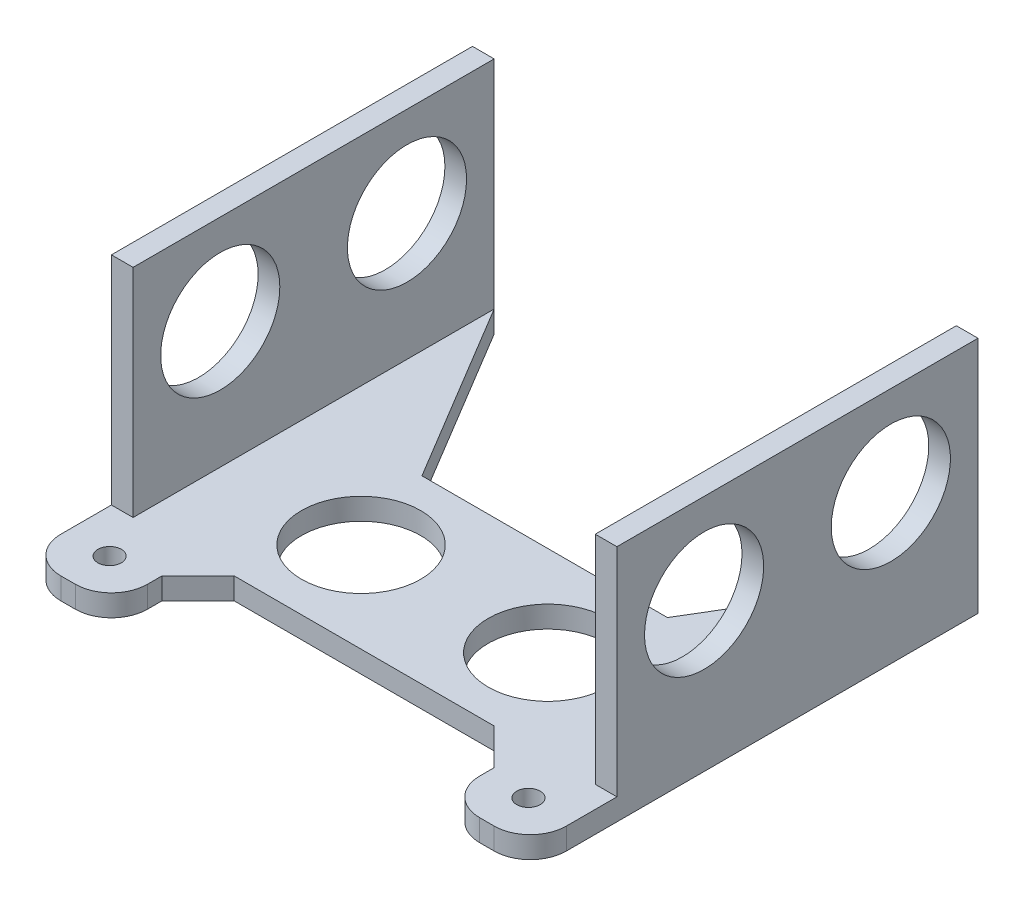
ISO-10303-21;
HEADER;
FILE_DESCRIPTION(('STEP AP214'),'2;1');
FILE_NAME('part.step','',(''),(''),'','','');
FILE_SCHEMA(('AUTOMOTIVE_DESIGN { 1 0 10303 214 1 1 1 1 }'));
ENDSEC;
DATA;
#1=APPLICATION_CONTEXT('core data for automotive mechanical design processes');
#2=APPLICATION_PROTOCOL_DEFINITION('international standard','automotive_design',2000,#1);
#3=PRODUCT_CONTEXT('',#1,'mechanical');
#4=PRODUCT('Part','Part','',(#3));
#5=PRODUCT_RELATED_PRODUCT_CATEGORY('part','',(#4));
#6=PRODUCT_DEFINITION_FORMATION('','',#4);
#7=PRODUCT_DEFINITION_CONTEXT('part definition',#1,'design');
#8=PRODUCT_DEFINITION('design','',#6,#7);
#9=PRODUCT_DEFINITION_SHAPE('','',#8);
#10=(LENGTH_UNIT() NAMED_UNIT(*) SI_UNIT(.MILLI.,.METRE.));
#11=(NAMED_UNIT(*) PLANE_ANGLE_UNIT() SI_UNIT($,.RADIAN.));
#12=(NAMED_UNIT(*) SI_UNIT($,.STERADIAN.) SOLID_ANGLE_UNIT());
#13=UNCERTAINTY_MEASURE_WITH_UNIT(LENGTH_MEASURE(1.E-05),#10,'distance_accuracy_value','');
#14=(GEOMETRIC_REPRESENTATION_CONTEXT(3) GLOBAL_UNCERTAINTY_ASSIGNED_CONTEXT((#13)) GLOBAL_UNIT_ASSIGNED_CONTEXT((#10,
#11,#12)) REPRESENTATION_CONTEXT('',''));
#15=CARTESIAN_POINT('',(0.,0.,0.));
#16=DIRECTION('',(0.,0.,1.));
#17=DIRECTION('',(1.,0.,0.));
#18=AXIS2_PLACEMENT_3D('',#15,#16,#17);
#19=CARTESIAN_POINT('',(32.,0.,-31.));
#20=DIRECTION('',(-0.857492925712544,0.,-0.514495755427526));
#21=DIRECTION('',(0.,-1.,0.));
#22=AXIS2_PLACEMENT_3D('',#19,#20,#21);
#23=PLANE('',#22);
#24=DIRECTION('',(0.,-1.,0.));
#25=VECTOR('',#24,1.);
#26=CARTESIAN_POINT('',(17.,0.,-6.00000000000001));
#27=LINE('',#26,#25);
#28=CARTESIAN_POINT('',(17.,3.,-6.00000000000001));
#29=VERTEX_POINT('',#28);
#30=CARTESIAN_POINT('',(17.,0.,-6.00000000000001));
#31=VERTEX_POINT('',#30);
#32=EDGE_CURVE('E379',#29,#31,#27,.T.);
#33=ORIENTED_EDGE('',*,*,#32,.F.);
#34=DIRECTION('',(0.514495755427526,0.,-0.857492925712544));
#35=VECTOR('',#34,1.);
#36=CARTESIAN_POINT('',(9.85294117647059,3.,5.91176470588235));
#37=LINE('',#36,#35);
#38=CARTESIAN_POINT('',(32.,3.,-31.));
#39=VERTEX_POINT('',#38);
#40=EDGE_CURVE('E384',#29,#39,#37,.T.);
#41=ORIENTED_EDGE('',*,*,#40,.T.);
#42=DIRECTION('',(0.,1.,0.));
#43=VECTOR('',#42,1.);
#44=CARTESIAN_POINT('',(32.,0.,-31.));
#45=LINE('',#44,#43);
#46=CARTESIAN_POINT('',(32.,0.,-31.));
#47=VERTEX_POINT('',#46);
#48=EDGE_CURVE('E233',#47,#39,#45,.T.);
#49=ORIENTED_EDGE('',*,*,#48,.F.);
#50=DIRECTION('',(-0.514495755427526,0.,0.857492925712544));
#51=VECTOR('',#50,1.);
#52=CARTESIAN_POINT('',(32.,0.,-31.));
#53=LINE('',#52,#51);
#54=EDGE_CURVE('E382',#47,#31,#53,.T.);
#55=ORIENTED_EDGE('',*,*,#54,.T.);
#56=EDGE_LOOP('',(#33,#41,#49,#55));
#57=FACE_BOUND('',#56,.T.);
#58=ADVANCED_FACE('F52',(#57),#23,.T.);
#59=CARTESIAN_POINT('',(-32.,0.,-31.));
#60=DIRECTION('',(0.857492925712544,0.,-0.514495755427526));
#61=DIRECTION('',(0.,1.,0.));
#62=AXIS2_PLACEMENT_3D('',#59,#60,#61);
#63=PLANE('',#62);
#64=DIRECTION('',(0.,1.,0.));
#65=VECTOR('',#64,1.);
#66=CARTESIAN_POINT('',(-32.,0.,-31.));
#67=LINE('',#66,#65);
#68=CARTESIAN_POINT('',(-32.,0.,-31.));
#69=VERTEX_POINT('',#68);
#70=CARTESIAN_POINT('',(-32.,3.,-31.));
#71=VERTEX_POINT('',#70);
#72=EDGE_CURVE('E283',#69,#71,#67,.T.);
#73=ORIENTED_EDGE('',*,*,#72,.T.);
#74=DIRECTION('',(0.514495755427526,0.,0.857492925712544));
#75=VECTOR('',#74,1.);
#76=CARTESIAN_POINT('',(-9.85294117647059,3.,5.91176470588235));
#77=LINE('',#76,#75);
#78=CARTESIAN_POINT('',(-17.,3.,-6.));
#79=VERTEX_POINT('',#78);
#80=EDGE_CURVE('E375',#71,#79,#77,.T.);
#81=ORIENTED_EDGE('',*,*,#80,.T.);
#82=DIRECTION('',(0.,1.,0.));
#83=VECTOR('',#82,1.);
#84=CARTESIAN_POINT('',(-17.,3.,-6.));
#85=LINE('',#84,#83);
#86=CARTESIAN_POINT('',(-17.,0.,-6.00000000000001));
#87=VERTEX_POINT('',#86);
#88=EDGE_CURVE('E372',#87,#79,#85,.T.);
#89=ORIENTED_EDGE('',*,*,#88,.F.);
#90=DIRECTION('',(-0.514495755427526,0.,-0.857492925712544));
#91=VECTOR('',#90,1.);
#92=CARTESIAN_POINT('',(-32.,0.,-31.));
#93=LINE('',#92,#91);
#94=EDGE_CURVE('E377',#87,#69,#93,.T.);
#95=ORIENTED_EDGE('',*,*,#94,.T.);
#96=EDGE_LOOP('',(#73,#81,#89,#95));
#97=FACE_BOUND('',#96,.T.);
#98=ADVANCED_FACE('F459',(#97),#63,.T.);
#99=CARTESIAN_POINT('',(-35.,3.,-31.));
#100=DIRECTION('',(0.,0.,1.));
#101=DIRECTION('',(1.,0.,0.));
#102=AXIS2_PLACEMENT_3D('',#99,#100,#101);
#103=PLANE('',#102);
#104=DIRECTION('',(0.,-1.,0.));
#105=VECTOR('',#104,1.);
#106=CARTESIAN_POINT('',(-35.,3.,-31.));
#107=LINE('',#106,#105);
#108=CARTESIAN_POINT('',(-35.,33.,-31.));
#109=VERTEX_POINT('',#108);
#110=CARTESIAN_POINT('',(-35.,0.,-31.));
#111=VERTEX_POINT('',#110);
#112=EDGE_CURVE('E345',#109,#111,#107,.T.);
#113=ORIENTED_EDGE('',*,*,#112,.F.);
#114=DIRECTION('',(-1.,0.,0.));
#115=VECTOR('',#114,1.);
#116=CARTESIAN_POINT('',(-32.,33.,-31.));
#117=LINE('',#116,#115);
#118=CARTESIAN_POINT('',(-32.,33.,-31.));
#119=VERTEX_POINT('',#118);
#120=EDGE_CURVE('E270',#119,#109,#117,.T.);
#121=ORIENTED_EDGE('',*,*,#120,.F.);
#122=DIRECTION('',(0.,-1.,0.));
#123=VECTOR('',#122,1.);
#124=CARTESIAN_POINT('',(-32.,3.,-31.));
#125=LINE('',#124,#123);
#126=EDGE_CURVE('E252',#119,#71,#125,.T.);
#127=ORIENTED_EDGE('',*,*,#126,.T.);
#128=ORIENTED_EDGE('',*,*,#72,.F.);
#129=DIRECTION('',(-1.,0.,0.));
#130=VECTOR('',#129,1.);
#131=CARTESIAN_POINT('',(-35.,0.,-31.));
#132=LINE('',#131,#130);
#133=EDGE_CURVE('E337',#69,#111,#132,.T.);
#134=ORIENTED_EDGE('',*,*,#133,.T.);
#135=EDGE_LOOP('',(#113,#121,#127,#128,#134));
#136=FACE_BOUND('',#135,.T.);
#137=ADVANCED_FACE('F465',(#136),#103,.F.);
#138=CARTESIAN_POINT('',(0.,3.,0.));
#139=DIRECTION('',(0.,-1.,0.));
#140=DIRECTION('',(0.,0.,-1.));
#141=AXIS2_PLACEMENT_3D('',#138,#139,#140);
#142=PLANE('',#141);
#143=CARTESIAN_POINT('',(29.,3.,25.25));
#144=DIRECTION('',(0.,-1.,0.));
#145=DIRECTION('',(0.,0.,-1.));
#146=AXIS2_PLACEMENT_3D('',#143,#144,#145);
#147=CIRCLE('',#146,1.625);
#148=CARTESIAN_POINT('',(29.,3.,23.625));
#149=VERTEX_POINT('',#148);
#150=EDGE_CURVE('E303',#149,#149,#147,.T.);
#151=ORIENTED_EDGE('',*,*,#150,.T.);
#152=EDGE_LOOP('',(#151));
#153=FACE_BOUND('',#152,.T.);
#154=CARTESIAN_POINT('',(-29.,3.,25.25));
#155=DIRECTION('',(0.,-1.,0.));
#156=DIRECTION('',(0.,0.,-1.));
#157=AXIS2_PLACEMENT_3D('',#154,#155,#156);
#158=CIRCLE('',#157,1.625);
#159=CARTESIAN_POINT('',(-29.,3.,23.625));
#160=VERTEX_POINT('',#159);
#161=EDGE_CURVE('E308',#160,#160,#158,.T.);
#162=ORIENTED_EDGE('',*,*,#161,.T.);
#163=EDGE_LOOP('',(#162));
#164=FACE_BOUND('',#163,.T.);
#165=CARTESIAN_POINT('',(12.93,3.,6.5));
#166=DIRECTION('',(0.,-1.,0.));
#167=DIRECTION('',(0.,0.,-1.));
#168=AXIS2_PLACEMENT_3D('',#165,#166,#167);
#169=CIRCLE('',#168,8.25);
#170=CARTESIAN_POINT('',(12.93,3.,-1.75));
#171=VERTEX_POINT('',#170);
#172=EDGE_CURVE('E291',#171,#171,#169,.T.);
#173=ORIENTED_EDGE('',*,*,#172,.T.);
#174=EDGE_LOOP('',(#173));
#175=FACE_BOUND('',#174,.T.);
#176=CARTESIAN_POINT('',(-12.93,3.,6.5));
#177=DIRECTION('',(0.,-1.,0.));
#178=DIRECTION('',(0.,0.,-1.));
#179=AXIS2_PLACEMENT_3D('',#176,#177,#178);
#180=CIRCLE('',#179,8.25);
#181=CARTESIAN_POINT('',(-12.93,3.,-1.75));
#182=VERTEX_POINT('',#181);
#183=EDGE_CURVE('E296',#182,#182,#180,.T.);
#184=ORIENTED_EDGE('',*,*,#183,.T.);
#185=EDGE_LOOP('',(#184));
#186=FACE_BOUND('',#185,.T.);
#187=DIRECTION('',(1.,0.,0.));
#188=VECTOR('',#187,1.);
#189=CARTESIAN_POINT('',(-35.,3.,31.));
#190=LINE('',#189,#188);
#191=CARTESIAN_POINT('',(-30.,3.,31.));
#192=VERTEX_POINT('',#191);
#193=CARTESIAN_POINT('',(-28.,3.,31.));
#194=VERTEX_POINT('',#193);
#195=EDGE_CURVE('E335',#192,#194,#190,.T.);
#196=ORIENTED_EDGE('',*,*,#195,.T.);
#197=CARTESIAN_POINT('',(-28.,3.,26.));
#198=DIRECTION('',(0.,-1.,0.));
#199=DIRECTION('',(0.,0.,-1.));
#200=AXIS2_PLACEMENT_3D('',#197,#198,#199);
#201=CIRCLE('',#200,5.);
#202=CARTESIAN_POINT('',(-23.,3.,26.));
#203=VERTEX_POINT('',#202);
#204=EDGE_CURVE('E398',#194,#203,#201,.F.);
#205=ORIENTED_EDGE('',*,*,#204,.T.);
#206=DIRECTION('',(0.,0.,1.));
#207=VECTOR('',#206,1.);
#208=CARTESIAN_POINT('',(-23.,3.,31.));
#209=LINE('',#208,#207);
#210=CARTESIAN_POINT('',(-23.,3.,24.));
#211=VERTEX_POINT('',#210);
#212=EDGE_CURVE('E319',#211,#203,#209,.T.);
#213=ORIENTED_EDGE('',*,*,#212,.F.);
#214=DIRECTION('',(-0.707106781186547,0.,0.707106781186548));
#215=VECTOR('',#214,1.);
#216=CARTESIAN_POINT('',(0.499999999999986,3.,0.499999999999986));
#217=LINE('',#216,#215);
#218=CARTESIAN_POINT('',(-18.,3.,19.));
#219=VERTEX_POINT('',#218);
#220=EDGE_CURVE('E356',#219,#211,#217,.T.);
#221=ORIENTED_EDGE('',*,*,#220,.F.);
#222=DIRECTION('',(-1.,0.,0.));
#223=VECTOR('',#222,1.);
#224=CARTESIAN_POINT('',(0.,3.,19.));
#225=LINE('',#224,#223);
#226=CARTESIAN_POINT('',(18.,3.,19.));
#227=VERTEX_POINT('',#226);
#228=EDGE_CURVE('E311',#227,#219,#225,.T.);
#229=ORIENTED_EDGE('',*,*,#228,.F.);
#230=DIRECTION('',(-0.707106781186548,0.,-0.707106781186547));
#231=VECTOR('',#230,1.);
#232=CARTESIAN_POINT('',(-0.500000000000008,3.,0.500000000000008));
#233=LINE('',#232,#231);
#234=CARTESIAN_POINT('',(23.,3.,24.));
#235=VERTEX_POINT('',#234);
#236=EDGE_CURVE('E367',#235,#227,#233,.T.);
#237=ORIENTED_EDGE('',*,*,#236,.F.);
#238=DIRECTION('',(0.,0.,-1.));
#239=VECTOR('',#238,1.);
#240=CARTESIAN_POINT('',(23.,3.,21.));
#241=LINE('',#240,#239);
#242=CARTESIAN_POINT('',(23.,3.,26.));
#243=VERTEX_POINT('',#242);
#244=EDGE_CURVE('E314',#243,#235,#241,.T.);
#245=ORIENTED_EDGE('',*,*,#244,.F.);
#246=CARTESIAN_POINT('',(28.,3.,26.));
#247=DIRECTION('',(0.,-1.,0.));
#248=DIRECTION('',(0.,0.,-1.));
#249=AXIS2_PLACEMENT_3D('',#246,#247,#248);
#250=CIRCLE('',#249,5.);
#251=CARTESIAN_POINT('',(28.,3.,31.));
#252=VERTEX_POINT('',#251);
#253=EDGE_CURVE('E394',#243,#252,#250,.F.);
#254=ORIENTED_EDGE('',*,*,#253,.T.);
#255=CARTESIAN_POINT('',(30.,3.,31.));
#256=VERTEX_POINT('',#255);
#257=EDGE_CURVE('E332',#252,#256,#190,.T.);
#258=ORIENTED_EDGE('',*,*,#257,.T.);
#259=CARTESIAN_POINT('',(30.,3.,26.));
#260=DIRECTION('',(0.,-1.,0.));
#261=DIRECTION('',(0.,0.,-1.));
#262=AXIS2_PLACEMENT_3D('',#259,#260,#261);
#263=CIRCLE('',#262,5.);
#264=CARTESIAN_POINT('',(35.,3.,26.));
#265=VERTEX_POINT('',#264);
#266=EDGE_CURVE('E396',#256,#265,#263,.F.);
#267=ORIENTED_EDGE('',*,*,#266,.T.);
#268=DIRECTION('',(0.,0.,-1.));
#269=VECTOR('',#268,1.);
#270=CARTESIAN_POINT('',(35.,3.,31.));
#271=LINE('',#270,#269);
#272=CARTESIAN_POINT('',(35.,3.,19.));
#273=VERTEX_POINT('',#272);
#274=EDGE_CURVE('E326',#265,#273,#271,.T.);
#275=ORIENTED_EDGE('',*,*,#274,.T.);
#276=DIRECTION('',(1.,0.,0.));
#277=VECTOR('',#276,1.);
#278=CARTESIAN_POINT('',(32.,3.,19.));
#279=LINE('',#278,#277);
#280=CARTESIAN_POINT('',(32.,3.,19.));
#281=VERTEX_POINT('',#280);
#282=EDGE_CURVE('E247',#281,#273,#279,.T.);
#283=ORIENTED_EDGE('',*,*,#282,.F.);
#284=DIRECTION('',(0.,0.,-1.));
#285=VECTOR('',#284,1.);
#286=CARTESIAN_POINT('',(32.,3.,-31.));
#287=LINE('',#286,#285);
#288=EDGE_CURVE('E219',#281,#39,#287,.T.);
#289=ORIENTED_EDGE('',*,*,#288,.T.);
#290=ORIENTED_EDGE('',*,*,#40,.F.);
#291=DIRECTION('',(1.,0.,0.));
#292=VECTOR('',#291,1.);
#293=CARTESIAN_POINT('',(0.,3.,-6.00000000000001));
#294=LINE('',#293,#292);
#295=EDGE_CURVE('E273',#79,#29,#294,.T.);
#296=ORIENTED_EDGE('',*,*,#295,.F.);
#297=ORIENTED_EDGE('',*,*,#80,.F.);
#298=DIRECTION('',(0.,0.,1.));
#299=VECTOR('',#298,1.);
#300=CARTESIAN_POINT('',(-32.,3.,-31.));
#301=LINE('',#300,#299);
#302=CARTESIAN_POINT('',(-32.,3.,19.));
#303=VERTEX_POINT('',#302);
#304=EDGE_CURVE('E255',#71,#303,#301,.T.);
#305=ORIENTED_EDGE('',*,*,#304,.T.);
#306=DIRECTION('',(-1.,0.,0.));
#307=VECTOR('',#306,1.);
#308=CARTESIAN_POINT('',(-32.,3.,19.));
#309=LINE('',#308,#307);
#310=CARTESIAN_POINT('',(-35.,3.,19.));
#311=VERTEX_POINT('',#310);
#312=EDGE_CURVE('E265',#303,#311,#309,.T.);
#313=ORIENTED_EDGE('',*,*,#312,.T.);
#314=DIRECTION('',(0.,0.,1.));
#315=VECTOR('',#314,1.);
#316=CARTESIAN_POINT('',(-35.,3.,31.));
#317=LINE('',#316,#315);
#318=CARTESIAN_POINT('',(-35.,3.,26.));
#319=VERTEX_POINT('',#318);
#320=EDGE_CURVE('E328',#311,#319,#317,.T.);
#321=ORIENTED_EDGE('',*,*,#320,.T.);
#322=CARTESIAN_POINT('',(-30.,3.,26.));
#323=DIRECTION('',(0.,-1.,0.));
#324=DIRECTION('',(0.,0.,-1.));
#325=AXIS2_PLACEMENT_3D('',#322,#323,#324);
#326=CIRCLE('',#325,5.);
#327=EDGE_CURVE('E392',#319,#192,#326,.F.);
#328=ORIENTED_EDGE('',*,*,#327,.T.);
#329=EDGE_LOOP('',(#196,#205,#213,#221,#229,#237,#245,#254,#258,#267,#275,#283,#289,#290,#296,
#297,#305,#313,#321,#328));
#330=FACE_BOUND('',#329,.T.);
#331=ADVANCED_FACE('F496',(#153,#164,#175,#186,#330),#142,.F.);
#332=CARTESIAN_POINT('',(0.,0.,0.));
#333=DIRECTION('',(0.,-1.,0.));
#334=DIRECTION('',(0.,0.,-1.));
#335=AXIS2_PLACEMENT_3D('',#332,#333,#334);
#336=PLANE('',#335);
#337=DIRECTION('',(0.,0.,1.));
#338=VECTOR('',#337,1.);
#339=CARTESIAN_POINT('',(-23.,0.,31.));
#340=LINE('',#339,#338);
#341=CARTESIAN_POINT('',(-23.,0.,24.));
#342=VERTEX_POINT('',#341);
#343=CARTESIAN_POINT('',(-23.,0.,26.));
#344=VERTEX_POINT('',#343);
#345=EDGE_CURVE('E318',#342,#344,#340,.T.);
#346=ORIENTED_EDGE('',*,*,#345,.T.);
#347=CARTESIAN_POINT('',(-28.,0.,26.));
#348=DIRECTION('',(0.,-1.,0.));
#349=DIRECTION('',(0.,0.,-1.));
#350=AXIS2_PLACEMENT_3D('',#347,#348,#349);
#351=CIRCLE('',#350,5.);
#352=CARTESIAN_POINT('',(-28.,0.,31.));
#353=VERTEX_POINT('',#352);
#354=EDGE_CURVE('E406',#344,#353,#351,.T.);
#355=ORIENTED_EDGE('',*,*,#354,.T.);
#356=DIRECTION('',(1.,0.,0.));
#357=VECTOR('',#356,1.);
#358=CARTESIAN_POINT('',(-35.,0.,31.));
#359=LINE('',#358,#357);
#360=CARTESIAN_POINT('',(-30.,0.,31.));
#361=VERTEX_POINT('',#360);
#362=EDGE_CURVE('E329',#361,#353,#359,.T.);
#363=ORIENTED_EDGE('',*,*,#362,.F.);
#364=CARTESIAN_POINT('',(-30.,0.,26.));
#365=DIRECTION('',(0.,-1.,0.));
#366=DIRECTION('',(0.,0.,-1.));
#367=AXIS2_PLACEMENT_3D('',#364,#365,#366);
#368=CIRCLE('',#367,5.);
#369=CARTESIAN_POINT('',(-35.,0.,26.));
#370=VERTEX_POINT('',#369);
#371=EDGE_CURVE('E69',#361,#370,#368,.T.);
#372=ORIENTED_EDGE('',*,*,#371,.T.);
#373=DIRECTION('',(0.,0.,1.));
#374=VECTOR('',#373,1.);
#375=CARTESIAN_POINT('',(-35.,0.,31.));
#376=LINE('',#375,#374);
#377=EDGE_CURVE('E340',#111,#370,#376,.T.);
#378=ORIENTED_EDGE('',*,*,#377,.F.);
#379=ORIENTED_EDGE('',*,*,#133,.F.);
#380=ORIENTED_EDGE('',*,*,#94,.F.);
#381=DIRECTION('',(1.,0.,0.));
#382=VECTOR('',#381,1.);
#383=CARTESIAN_POINT('',(32.,0.,-6.00000000000001));
#384=LINE('',#383,#382);
#385=EDGE_CURVE('E278',#87,#31,#384,.T.);
#386=ORIENTED_EDGE('',*,*,#385,.T.);
#387=ORIENTED_EDGE('',*,*,#54,.F.);
#388=CARTESIAN_POINT('',(35.,0.,-31.));
#389=VERTEX_POINT('',#388);
#390=EDGE_CURVE('E338',#389,#47,#132,.T.);
#391=ORIENTED_EDGE('',*,*,#390,.F.);
#392=DIRECTION('',(0.,0.,-1.));
#393=VECTOR('',#392,1.);
#394=CARTESIAN_POINT('',(35.,0.,31.));
#395=LINE('',#394,#393);
#396=CARTESIAN_POINT('',(35.,0.,26.));
#397=VERTEX_POINT('',#396);
#398=EDGE_CURVE('E322',#397,#389,#395,.T.);
#399=ORIENTED_EDGE('',*,*,#398,.F.);
#400=CARTESIAN_POINT('',(30.,0.,26.));
#401=DIRECTION('',(0.,-1.,0.));
#402=DIRECTION('',(0.,0.,-1.));
#403=AXIS2_PLACEMENT_3D('',#400,#401,#402);
#404=CIRCLE('',#403,5.);
#405=CARTESIAN_POINT('',(30.,0.,31.));
#406=VERTEX_POINT('',#405);
#407=EDGE_CURVE('E404',#397,#406,#404,.T.);
#408=ORIENTED_EDGE('',*,*,#407,.T.);
#409=CARTESIAN_POINT('',(28.,0.,31.));
#410=VERTEX_POINT('',#409);
#411=EDGE_CURVE('E342',#410,#406,#359,.T.);
#412=ORIENTED_EDGE('',*,*,#411,.F.);
#413=CARTESIAN_POINT('',(28.,0.,26.));
#414=DIRECTION('',(0.,-1.,0.));
#415=DIRECTION('',(0.,0.,-1.));
#416=AXIS2_PLACEMENT_3D('',#413,#414,#415);
#417=CIRCLE('',#416,5.);
#418=CARTESIAN_POINT('',(23.,0.,26.));
#419=VERTEX_POINT('',#418);
#420=EDGE_CURVE('E76',#410,#419,#417,.T.);
#421=ORIENTED_EDGE('',*,*,#420,.T.);
#422=DIRECTION('',(0.,0.,-1.));
#423=VECTOR('',#422,1.);
#424=CARTESIAN_POINT('',(23.,0.,21.));
#425=LINE('',#424,#423);
#426=CARTESIAN_POINT('',(23.,0.,24.));
#427=VERTEX_POINT('',#426);
#428=EDGE_CURVE('E316',#419,#427,#425,.T.);
#429=ORIENTED_EDGE('',*,*,#428,.T.);
#430=DIRECTION('',(0.707106781186548,0.,0.707106781186547));
#431=VECTOR('',#430,1.);
#432=CARTESIAN_POINT('',(23.,0.,24.));
#433=LINE('',#432,#431);
#434=CARTESIAN_POINT('',(18.,0.,19.));
#435=VERTEX_POINT('',#434);
#436=EDGE_CURVE('E369',#435,#427,#433,.T.);
#437=ORIENTED_EDGE('',*,*,#436,.F.);
#438=DIRECTION('',(-1.,0.,0.));
#439=VECTOR('',#438,1.);
#440=CARTESIAN_POINT('',(0.,0.,19.));
#441=LINE('',#440,#439);
#442=CARTESIAN_POINT('',(-18.,0.,19.));
#443=VERTEX_POINT('',#442);
#444=EDGE_CURVE('E312',#435,#443,#441,.T.);
#445=ORIENTED_EDGE('',*,*,#444,.T.);
#446=DIRECTION('',(0.707106781186547,0.,-0.707106781186548));
#447=VECTOR('',#446,1.);
#448=CARTESIAN_POINT('',(-18.,0.,19.));
#449=LINE('',#448,#447);
#450=EDGE_CURVE('E358',#342,#443,#449,.T.);
#451=ORIENTED_EDGE('',*,*,#450,.F.);
#452=EDGE_LOOP('',(#346,#355,#363,#372,#378,#379,#380,#386,#387,#391,#399,#408,#412,#421,#429,
#437,#445,#451));
#453=FACE_BOUND('',#452,.T.);
#454=CARTESIAN_POINT('',(-12.93,0.,6.5));
#455=DIRECTION('',(0.,1.,0.));
#456=DIRECTION('',(0.,0.,1.));
#457=AXIS2_PLACEMENT_3D('',#454,#455,#456);
#458=CIRCLE('',#457,8.25);
#459=CARTESIAN_POINT('',(-12.93,0.,14.75));
#460=VERTEX_POINT('',#459);
#461=EDGE_CURVE('E288',#460,#460,#458,.T.);
#462=ORIENTED_EDGE('',*,*,#461,.T.);
#463=EDGE_LOOP('',(#462));
#464=FACE_BOUND('',#463,.T.);
#465=CARTESIAN_POINT('',(12.93,0.,6.5));
#466=DIRECTION('',(0.,1.,0.));
#467=DIRECTION('',(0.,0.,1.));
#468=AXIS2_PLACEMENT_3D('',#465,#466,#467);
#469=CIRCLE('',#468,8.25);
#470=CARTESIAN_POINT('',(12.93,0.,14.75));
#471=VERTEX_POINT('',#470);
#472=EDGE_CURVE('E286',#471,#471,#469,.T.);
#473=ORIENTED_EDGE('',*,*,#472,.T.);
#474=EDGE_LOOP('',(#473));
#475=FACE_BOUND('',#474,.T.);
#476=CARTESIAN_POINT('',(-29.,0.,25.25));
#477=DIRECTION('',(0.,1.,0.));
#478=DIRECTION('',(0.,0.,1.));
#479=AXIS2_PLACEMENT_3D('',#476,#477,#478);
#480=CIRCLE('',#479,1.625);
#481=CARTESIAN_POINT('',(-29.,0.,26.875));
#482=VERTEX_POINT('',#481);
#483=EDGE_CURVE('E300',#482,#482,#480,.T.);
#484=ORIENTED_EDGE('',*,*,#483,.T.);
#485=EDGE_LOOP('',(#484));
#486=FACE_BOUND('',#485,.T.);
#487=CARTESIAN_POINT('',(29.,0.,25.25));
#488=DIRECTION('',(0.,1.,0.));
#489=DIRECTION('',(0.,0.,1.));
#490=AXIS2_PLACEMENT_3D('',#487,#488,#489);
#491=CIRCLE('',#490,1.625);
#492=CARTESIAN_POINT('',(29.,0.,26.875));
#493=VERTEX_POINT('',#492);
#494=EDGE_CURVE('E299',#493,#493,#491,.T.);
#495=ORIENTED_EDGE('',*,*,#494,.T.);
#496=EDGE_LOOP('',(#495));
#497=FACE_BOUND('',#496,.T.);
#498=ADVANCED_FACE('F574',(#453,#464,#475,#486,#497),#336,.T.);
#499=CARTESIAN_POINT('',(23.,0.,24.));
#500=DIRECTION('',(-0.707106781186547,0.,0.707106781186548));
#501=DIRECTION('',(0.,1.,0.));
#502=AXIS2_PLACEMENT_3D('',#499,#500,#501);
#503=PLANE('',#502);
#504=DIRECTION('',(0.,-1.,0.));
#505=VECTOR('',#504,1.);
#506=CARTESIAN_POINT('',(23.,3.,24.));
#507=LINE('',#506,#505);
#508=EDGE_CURVE('E361',#235,#427,#507,.T.);
#509=ORIENTED_EDGE('',*,*,#508,.F.);
#510=ORIENTED_EDGE('',*,*,#236,.T.);
#511=DIRECTION('',(0.,1.,0.));
#512=VECTOR('',#511,1.);
#513=CARTESIAN_POINT('',(18.,3.,19.));
#514=LINE('',#513,#512);
#515=EDGE_CURVE('E364',#435,#227,#514,.T.);
#516=ORIENTED_EDGE('',*,*,#515,.F.);
#517=ORIENTED_EDGE('',*,*,#436,.T.);
#518=EDGE_LOOP('',(#509,#510,#516,#517));
#519=FACE_BOUND('',#518,.T.);
#520=ADVANCED_FACE('F578',(#519),#503,.T.);
#521=CARTESIAN_POINT('',(-18.,0.,19.));
#522=DIRECTION('',(0.707106781186548,0.,0.707106781186547));
#523=DIRECTION('',(0.,1.,0.));
#524=AXIS2_PLACEMENT_3D('',#521,#522,#523);
#525=PLANE('',#524);
#526=DIRECTION('',(0.,-1.,0.));
#527=VECTOR('',#526,1.);
#528=CARTESIAN_POINT('',(-18.,3.,19.));
#529=LINE('',#528,#527);
#530=EDGE_CURVE('E350',#219,#443,#529,.T.);
#531=ORIENTED_EDGE('',*,*,#530,.F.);
#532=ORIENTED_EDGE('',*,*,#220,.T.);
#533=DIRECTION('',(0.,1.,0.));
#534=VECTOR('',#533,1.);
#535=CARTESIAN_POINT('',(-23.,3.,24.));
#536=LINE('',#535,#534);
#537=EDGE_CURVE('E353',#342,#211,#536,.T.);
#538=ORIENTED_EDGE('',*,*,#537,.F.);
#539=ORIENTED_EDGE('',*,*,#450,.T.);
#540=EDGE_LOOP('',(#531,#532,#538,#539));
#541=FACE_BOUND('',#540,.T.);
#542=ADVANCED_FACE('F590',(#541),#525,.T.);
#543=CARTESIAN_POINT('',(-35.,3.,31.));
#544=DIRECTION('',(0.,0.,-1.));
#545=DIRECTION('',(-1.,0.,0.));
#546=AXIS2_PLACEMENT_3D('',#543,#544,#545);
#547=PLANE('',#546);
#548=ORIENTED_EDGE('',*,*,#362,.T.);
#549=DIRECTION('',(0.,1.,0.));
#550=VECTOR('',#549,1.);
#551=CARTESIAN_POINT('',(-28.,3.,31.));
#552=LINE('',#551,#550);
#553=EDGE_CURVE('E389',#353,#194,#552,.T.);
#554=ORIENTED_EDGE('',*,*,#553,.T.);
#555=ORIENTED_EDGE('',*,*,#195,.F.);
#556=DIRECTION('',(0.,-1.,0.));
#557=VECTOR('',#556,1.);
#558=CARTESIAN_POINT('',(-30.,3.,31.));
#559=LINE('',#558,#557);
#560=EDGE_CURVE('E386',#192,#361,#559,.T.);
#561=ORIENTED_EDGE('',*,*,#560,.T.);
#562=EDGE_LOOP('',(#548,#554,#555,#561));
#563=FACE_BOUND('',#562,.T.);
#564=ADVANCED_FACE('F581',(#563),#547,.F.);
#565=CARTESIAN_POINT('',(35.,3.,31.));
#566=DIRECTION('',(-1.,0.,0.));
#567=DIRECTION('',(0.,0.,1.));
#568=AXIS2_PLACEMENT_3D('',#565,#566,#567);
#569=PLANE('',#568);
#570=CARTESIAN_POINT('',(35.,20.5,-18.93));
#571=DIRECTION('',(-1.,0.,0.));
#572=DIRECTION('',(0.,0.,1.));
#573=AXIS2_PLACEMENT_3D('',#570,#571,#572);
#574=CIRCLE('',#573,8.25);
#575=CARTESIAN_POINT('',(35.,20.5,-10.68));
#576=VERTEX_POINT('',#575);
#577=EDGE_CURVE('E419',#576,#576,#574,.T.);
#578=ORIENTED_EDGE('',*,*,#577,.T.);
#579=EDGE_LOOP('',(#578));
#580=FACE_BOUND('',#579,.T.);
#581=CARTESIAN_POINT('',(35.,20.5,6.93));
#582=DIRECTION('',(-1.,0.,0.));
#583=DIRECTION('',(0.,0.,1.));
#584=AXIS2_PLACEMENT_3D('',#581,#582,#583);
#585=CIRCLE('',#584,8.25);
#586=CARTESIAN_POINT('',(35.,20.5,15.18));
#587=VERTEX_POINT('',#586);
#588=EDGE_CURVE('E426',#587,#587,#585,.T.);
#589=ORIENTED_EDGE('',*,*,#588,.T.);
#590=EDGE_LOOP('',(#589));
#591=FACE_BOUND('',#590,.T.);
#592=ORIENTED_EDGE('',*,*,#274,.F.);
#593=DIRECTION('',(0.,-1.,0.));
#594=VECTOR('',#593,1.);
#595=CARTESIAN_POINT('',(35.,3.,26.));
#596=LINE('',#595,#594);
#597=EDGE_CURVE('E408',#265,#397,#596,.T.);
#598=ORIENTED_EDGE('',*,*,#597,.T.);
#599=ORIENTED_EDGE('',*,*,#398,.T.);
#600=DIRECTION('',(0.,-1.,0.));
#601=VECTOR('',#600,1.);
#602=CARTESIAN_POINT('',(35.,3.,-31.));
#603=LINE('',#602,#601);
#604=CARTESIAN_POINT('',(35.,33.,-31.));
#605=VERTEX_POINT('',#604);
#606=EDGE_CURVE('E348',#605,#389,#603,.T.);
#607=ORIENTED_EDGE('',*,*,#606,.F.);
#608=DIRECTION('',(0.,0.,1.));
#609=VECTOR('',#608,1.);
#610=CARTESIAN_POINT('',(35.,33.,-31.));
#611=LINE('',#610,#609);
#612=CARTESIAN_POINT('',(35.,33.,19.));
#613=VERTEX_POINT('',#612);
#614=EDGE_CURVE('E214',#605,#613,#611,.T.);
#615=ORIENTED_EDGE('',*,*,#614,.T.);
#616=DIRECTION('',(0.,-1.,0.));
#617=VECTOR('',#616,1.);
#618=CARTESIAN_POINT('',(35.,3.,19.));
#619=LINE('',#618,#617);
#620=EDGE_CURVE('E235',#613,#273,#619,.T.);
#621=ORIENTED_EDGE('',*,*,#620,.T.);
#622=EDGE_LOOP('',(#592,#598,#599,#607,#615,#621));
#623=FACE_BOUND('',#622,.T.);
#624=ADVANCED_FACE('F505',(#580,#591,#623),#569,.F.);
#625=ORIENTED_EDGE('',*,*,#390,.T.);
#626=ORIENTED_EDGE('',*,*,#48,.T.);
#627=DIRECTION('',(0.,1.,0.));
#628=VECTOR('',#627,1.);
#629=CARTESIAN_POINT('',(32.,3.,-31.));
#630=LINE('',#629,#628);
#631=CARTESIAN_POINT('',(32.,33.,-31.));
#632=VERTEX_POINT('',#631);
#633=EDGE_CURVE('E226',#39,#632,#630,.T.);
#634=ORIENTED_EDGE('',*,*,#633,.T.);
#635=DIRECTION('',(1.,0.,0.));
#636=VECTOR('',#635,1.);
#637=CARTESIAN_POINT('',(32.,33.,-31.));
#638=LINE('',#637,#636);
#639=EDGE_CURVE('E209',#632,#605,#638,.T.);
#640=ORIENTED_EDGE('',*,*,#639,.T.);
#641=ORIENTED_EDGE('',*,*,#606,.T.);
#642=EDGE_LOOP('',(#625,#626,#634,#640,#641));
#643=FACE_BOUND('',#642,.T.);
#644=ADVANCED_FACE('F231',(#643),#103,.F.);
#645=CARTESIAN_POINT('',(-35.,3.,31.));
#646=DIRECTION('',(1.,0.,0.));
#647=DIRECTION('',(0.,0.,-1.));
#648=AXIS2_PLACEMENT_3D('',#645,#646,#647);
#649=PLANE('',#648);
#650=CARTESIAN_POINT('',(-35.,20.5,-18.93));
#651=DIRECTION('',(1.,0.,0.));
#652=DIRECTION('',(0.,0.,-1.));
#653=AXIS2_PLACEMENT_3D('',#650,#651,#652);
#654=CIRCLE('',#653,8.25);
#655=CARTESIAN_POINT('',(-35.,20.5,-27.18));
#656=VERTEX_POINT('',#655);
#657=EDGE_CURVE('E240',#656,#656,#654,.T.);
#658=ORIENTED_EDGE('',*,*,#657,.T.);
#659=EDGE_LOOP('',(#658));
#660=FACE_BOUND('',#659,.T.);
#661=CARTESIAN_POINT('',(-35.,20.5,6.93));
#662=DIRECTION('',(1.,0.,0.));
#663=DIRECTION('',(0.,0.,-1.));
#664=AXIS2_PLACEMENT_3D('',#661,#662,#663);
#665=CIRCLE('',#664,8.25);
#666=CARTESIAN_POINT('',(-35.,20.5,-1.32000000000001));
#667=VERTEX_POINT('',#666);
#668=EDGE_CURVE('E423',#667,#667,#665,.T.);
#669=ORIENTED_EDGE('',*,*,#668,.T.);
#670=EDGE_LOOP('',(#669));
#671=FACE_BOUND('',#670,.T.);
#672=ORIENTED_EDGE('',*,*,#377,.T.);
#673=DIRECTION('',(0.,-1.,0.));
#674=VECTOR('',#673,1.);
#675=CARTESIAN_POINT('',(-35.,3.,26.));
#676=LINE('',#675,#674);
#677=EDGE_CURVE('E13',#370,#319,#676,.F.);
#678=ORIENTED_EDGE('',*,*,#677,.T.);
#679=ORIENTED_EDGE('',*,*,#320,.F.);
#680=DIRECTION('',(0.,1.,0.));
#681=VECTOR('',#680,1.);
#682=CARTESIAN_POINT('',(-35.,3.,19.));
#683=LINE('',#682,#681);
#684=CARTESIAN_POINT('',(-35.,33.,19.));
#685=VERTEX_POINT('',#684);
#686=EDGE_CURVE('E250',#311,#685,#683,.T.);
#687=ORIENTED_EDGE('',*,*,#686,.T.);
#688=DIRECTION('',(0.,0.,-1.));
#689=VECTOR('',#688,1.);
#690=CARTESIAN_POINT('',(-35.,33.,-31.));
#691=LINE('',#690,#689);
#692=EDGE_CURVE('E256',#685,#109,#691,.T.);
#693=ORIENTED_EDGE('',*,*,#692,.T.);
#694=ORIENTED_EDGE('',*,*,#112,.T.);
#695=EDGE_LOOP('',(#672,#678,#679,#687,#693,#694));
#696=FACE_BOUND('',#695,.T.);
#697=ADVANCED_FACE('F529',(#660,#671,#696),#649,.F.);
#698=ORIENTED_EDGE('',*,*,#411,.T.);
#699=DIRECTION('',(0.,-1.,0.));
#700=VECTOR('',#699,1.);
#701=CARTESIAN_POINT('',(30.,3.,31.));
#702=LINE('',#701,#700);
#703=EDGE_CURVE('E414',#406,#256,#702,.F.);
#704=ORIENTED_EDGE('',*,*,#703,.T.);
#705=ORIENTED_EDGE('',*,*,#257,.F.);
#706=DIRECTION('',(0.,-1.,0.));
#707=VECTOR('',#706,1.);
#708=CARTESIAN_POINT('',(28.,3.,31.));
#709=LINE('',#708,#707);
#710=EDGE_CURVE('E411',#252,#410,#709,.T.);
#711=ORIENTED_EDGE('',*,*,#710,.T.);
#712=EDGE_LOOP('',(#698,#704,#705,#711));
#713=FACE_BOUND('',#712,.T.);
#714=ADVANCED_FACE('F500',(#713),#547,.F.);
#715=CARTESIAN_POINT('',(23.,0.,21.));
#716=DIRECTION('',(1.,0.,0.));
#717=DIRECTION('',(0.,0.,-1.));
#718=AXIS2_PLACEMENT_3D('',#715,#716,#717);
#719=PLANE('',#718);
#720=ORIENTED_EDGE('',*,*,#428,.F.);
#721=DIRECTION('',(0.,-1.,0.));
#722=VECTOR('',#721,1.);
#723=CARTESIAN_POINT('',(23.,0.,26.));
#724=LINE('',#723,#722);
#725=EDGE_CURVE('E61',#419,#243,#724,.F.);
#726=ORIENTED_EDGE('',*,*,#725,.T.);
#727=ORIENTED_EDGE('',*,*,#244,.T.);
#728=ORIENTED_EDGE('',*,*,#508,.T.);
#729=EDGE_LOOP('',(#720,#726,#727,#728));
#730=FACE_BOUND('',#729,.T.);
#731=ADVANCED_FACE('F567',(#730),#719,.F.);
#732=CARTESIAN_POINT('',(-23.,0.,31.));
#733=DIRECTION('',(-1.,0.,0.));
#734=DIRECTION('',(0.,0.,1.));
#735=AXIS2_PLACEMENT_3D('',#732,#733,#734);
#736=PLANE('',#735);
#737=ORIENTED_EDGE('',*,*,#212,.T.);
#738=DIRECTION('',(0.,1.,0.));
#739=VECTOR('',#738,1.);
#740=CARTESIAN_POINT('',(-23.,0.,26.));
#741=LINE('',#740,#739);
#742=EDGE_CURVE('E400',#203,#344,#741,.F.);
#743=ORIENTED_EDGE('',*,*,#742,.T.);
#744=ORIENTED_EDGE('',*,*,#345,.F.);
#745=ORIENTED_EDGE('',*,*,#537,.T.);
#746=EDGE_LOOP('',(#737,#743,#744,#745));
#747=FACE_BOUND('',#746,.T.);
#748=ADVANCED_FACE('F563',(#747),#736,.F.);
#749=CARTESIAN_POINT('',(0.,0.,19.));
#750=DIRECTION('',(0.,0.,-1.));
#751=DIRECTION('',(-1.,0.,0.));
#752=AXIS2_PLACEMENT_3D('',#749,#750,#751);
#753=PLANE('',#752);
#754=ORIENTED_EDGE('',*,*,#444,.F.);
#755=ORIENTED_EDGE('',*,*,#515,.T.);
#756=ORIENTED_EDGE('',*,*,#228,.T.);
#757=ORIENTED_EDGE('',*,*,#530,.T.);
#758=EDGE_LOOP('',(#754,#755,#756,#757));
#759=FACE_BOUND('',#758,.T.);
#760=ADVANCED_FACE('F559',(#759),#753,.F.);
#761=CARTESIAN_POINT('',(29.,0.,25.25));
#762=DIRECTION('',(0.,1.,0.));
#763=DIRECTION('',(0.,0.,1.));
#764=AXIS2_PLACEMENT_3D('',#761,#762,#763);
#765=CYLINDRICAL_SURFACE('',#764,1.625);
#766=ORIENTED_EDGE('',*,*,#494,.F.);
#767=EDGE_LOOP('',(#766));
#768=FACE_BOUND('',#767,.T.);
#769=ORIENTED_EDGE('',*,*,#150,.F.);
#770=EDGE_LOOP('',(#769));
#771=FACE_BOUND('',#770,.T.);
#772=ADVANCED_FACE('F555',(#768,#771),#765,.F.);
#773=CARTESIAN_POINT('',(-29.,0.,25.25));
#774=DIRECTION('',(0.,1.,0.));
#775=DIRECTION('',(0.,0.,1.));
#776=AXIS2_PLACEMENT_3D('',#773,#774,#775);
#777=CYLINDRICAL_SURFACE('',#776,1.625);
#778=ORIENTED_EDGE('',*,*,#483,.F.);
#779=EDGE_LOOP('',(#778));
#780=FACE_BOUND('',#779,.T.);
#781=ORIENTED_EDGE('',*,*,#161,.F.);
#782=EDGE_LOOP('',(#781));
#783=FACE_BOUND('',#782,.T.);
#784=ADVANCED_FACE('F551',(#780,#783),#777,.F.);
#785=CARTESIAN_POINT('',(12.93,0.,6.5));
#786=DIRECTION('',(0.,1.,0.));
#787=DIRECTION('',(0.,0.,1.));
#788=AXIS2_PLACEMENT_3D('',#785,#786,#787);
#789=CYLINDRICAL_SURFACE('',#788,8.25);
#790=ORIENTED_EDGE('',*,*,#472,.F.);
#791=EDGE_LOOP('',(#790));
#792=FACE_BOUND('',#791,.T.);
#793=ORIENTED_EDGE('',*,*,#172,.F.);
#794=EDGE_LOOP('',(#793));
#795=FACE_BOUND('',#794,.T.);
#796=ADVANCED_FACE('F547',(#792,#795),#789,.F.);
#797=CARTESIAN_POINT('',(-12.93,0.,6.5));
#798=DIRECTION('',(0.,1.,0.));
#799=DIRECTION('',(0.,0.,1.));
#800=AXIS2_PLACEMENT_3D('',#797,#798,#799);
#801=CYLINDRICAL_SURFACE('',#800,8.25);
#802=ORIENTED_EDGE('',*,*,#461,.F.);
#803=EDGE_LOOP('',(#802));
#804=FACE_BOUND('',#803,.T.);
#805=ORIENTED_EDGE('',*,*,#183,.F.);
#806=EDGE_LOOP('',(#805));
#807=FACE_BOUND('',#806,.T.);
#808=ADVANCED_FACE('F544',(#804,#807),#801,.F.);
#809=CARTESIAN_POINT('',(0.,0.,-6.00000000000001));
#810=DIRECTION('',(0.,0.,1.));
#811=DIRECTION('',(1.,0.,0.));
#812=AXIS2_PLACEMENT_3D('',#809,#810,#811);
#813=PLANE('',#812);
#814=ORIENTED_EDGE('',*,*,#295,.T.);
#815=ORIENTED_EDGE('',*,*,#32,.T.);
#816=ORIENTED_EDGE('',*,*,#385,.F.);
#817=ORIENTED_EDGE('',*,*,#88,.T.);
#818=EDGE_LOOP('',(#814,#815,#816,#817));
#819=FACE_BOUND('',#818,.T.);
#820=ADVANCED_FACE('F514',(#819),#813,.F.);
#821=CARTESIAN_POINT('',(-32.,33.,-31.));
#822=DIRECTION('',(0.,1.,0.));
#823=DIRECTION('',(0.,0.,1.));
#824=AXIS2_PLACEMENT_3D('',#821,#822,#823);
#825=PLANE('',#824);
#826=ORIENTED_EDGE('',*,*,#692,.F.);
#827=DIRECTION('',(-1.,0.,0.));
#828=VECTOR('',#827,1.);
#829=CARTESIAN_POINT('',(-32.,33.,19.));
#830=LINE('',#829,#828);
#831=CARTESIAN_POINT('',(-32.,33.,19.));
#832=VERTEX_POINT('',#831);
#833=EDGE_CURVE('E274',#832,#685,#830,.T.);
#834=ORIENTED_EDGE('',*,*,#833,.F.);
#835=DIRECTION('',(0.,0.,-1.));
#836=VECTOR('',#835,1.);
#837=CARTESIAN_POINT('',(-32.,33.,-31.));
#838=LINE('',#837,#836);
#839=EDGE_CURVE('E262',#832,#119,#838,.T.);
#840=ORIENTED_EDGE('',*,*,#839,.T.);
#841=ORIENTED_EDGE('',*,*,#120,.T.);
#842=EDGE_LOOP('',(#826,#834,#840,#841));
#843=FACE_BOUND('',#842,.T.);
#844=ADVANCED_FACE('F527',(#843),#825,.T.);
#845=CARTESIAN_POINT('',(-32.,3.,19.));
#846=DIRECTION('',(0.,0.,1.));
#847=DIRECTION('',(1.,0.,0.));
#848=AXIS2_PLACEMENT_3D('',#845,#846,#847);
#849=PLANE('',#848);
#850=ORIENTED_EDGE('',*,*,#686,.F.);
#851=ORIENTED_EDGE('',*,*,#312,.F.);
#852=DIRECTION('',(0.,1.,0.));
#853=VECTOR('',#852,1.);
#854=CARTESIAN_POINT('',(-32.,3.,19.));
#855=LINE('',#854,#853);
#856=EDGE_CURVE('E259',#303,#832,#855,.T.);
#857=ORIENTED_EDGE('',*,*,#856,.T.);
#858=ORIENTED_EDGE('',*,*,#833,.T.);
#859=EDGE_LOOP('',(#850,#851,#857,#858));
#860=FACE_BOUND('',#859,.T.);
#861=ADVANCED_FACE('F531',(#860),#849,.T.);
#862=CARTESIAN_POINT('',(-32.,0.,0.));
#863=DIRECTION('',(1.,0.,0.));
#864=DIRECTION('',(0.,0.,-1.));
#865=AXIS2_PLACEMENT_3D('',#862,#863,#864);
#866=PLANE('',#865);
#867=CARTESIAN_POINT('',(-32.,20.5,-18.93));
#868=DIRECTION('',(1.,0.,0.));
#869=DIRECTION('',(0.,0.,-1.));
#870=AXIS2_PLACEMENT_3D('',#867,#868,#869);
#871=CIRCLE('',#870,8.25);
#872=CARTESIAN_POINT('',(-32.,20.5,-27.18));
#873=VERTEX_POINT('',#872);
#874=EDGE_CURVE('E434',#873,#873,#871,.T.);
#875=ORIENTED_EDGE('',*,*,#874,.F.);
#876=EDGE_LOOP('',(#875));
#877=FACE_BOUND('',#876,.T.);
#878=CARTESIAN_POINT('',(-32.,20.5,6.93));
#879=DIRECTION('',(1.,0.,0.));
#880=DIRECTION('',(0.,0.,-1.));
#881=AXIS2_PLACEMENT_3D('',#878,#879,#880);
#882=CIRCLE('',#881,8.25);
#883=CARTESIAN_POINT('',(-32.,20.5,-1.32000000000001));
#884=VERTEX_POINT('',#883);
#885=EDGE_CURVE('E418',#884,#884,#882,.T.);
#886=ORIENTED_EDGE('',*,*,#885,.F.);
#887=EDGE_LOOP('',(#886));
#888=FACE_BOUND('',#887,.T.);
#889=ORIENTED_EDGE('',*,*,#126,.F.);
#890=ORIENTED_EDGE('',*,*,#839,.F.);
#891=ORIENTED_EDGE('',*,*,#856,.F.);
#892=ORIENTED_EDGE('',*,*,#304,.F.);
#893=EDGE_LOOP('',(#889,#890,#891,#892));
#894=FACE_BOUND('',#893,.T.);
#895=ADVANCED_FACE('F521',(#877,#888,#894),#866,.T.);
#896=CARTESIAN_POINT('',(32.,3.,19.));
#897=DIRECTION('',(0.,0.,1.));
#898=DIRECTION('',(1.,0.,0.));
#899=AXIS2_PLACEMENT_3D('',#896,#897,#898);
#900=PLANE('',#899);
#901=ORIENTED_EDGE('',*,*,#620,.F.);
#902=DIRECTION('',(1.,0.,0.));
#903=VECTOR('',#902,1.);
#904=CARTESIAN_POINT('',(32.,33.,19.));
#905=LINE('',#904,#903);
#906=CARTESIAN_POINT('',(32.,33.,19.));
#907=VERTEX_POINT('',#906);
#908=EDGE_CURVE('E218',#907,#613,#905,.T.);
#909=ORIENTED_EDGE('',*,*,#908,.F.);
#910=DIRECTION('',(0.,-1.,0.));
#911=VECTOR('',#910,1.);
#912=CARTESIAN_POINT('',(32.,3.,19.));
#913=LINE('',#912,#911);
#914=EDGE_CURVE('E228',#907,#281,#913,.T.);
#915=ORIENTED_EDGE('',*,*,#914,.T.);
#916=ORIENTED_EDGE('',*,*,#282,.T.);
#917=EDGE_LOOP('',(#901,#909,#915,#916));
#918=FACE_BOUND('',#917,.T.);
#919=ADVANCED_FACE('F509',(#918),#900,.T.);
#920=CARTESIAN_POINT('',(32.,33.,-31.));
#921=DIRECTION('',(0.,1.,0.));
#922=DIRECTION('',(0.,0.,1.));
#923=AXIS2_PLACEMENT_3D('',#920,#921,#922);
#924=PLANE('',#923);
#925=ORIENTED_EDGE('',*,*,#614,.F.);
#926=ORIENTED_EDGE('',*,*,#639,.F.);
#927=DIRECTION('',(0.,0.,1.));
#928=VECTOR('',#927,1.);
#929=CARTESIAN_POINT('',(32.,33.,-31.));
#930=LINE('',#929,#928);
#931=EDGE_CURVE('E212',#632,#907,#930,.T.);
#932=ORIENTED_EDGE('',*,*,#931,.T.);
#933=ORIENTED_EDGE('',*,*,#908,.T.);
#934=EDGE_LOOP('',(#925,#926,#932,#933));
#935=FACE_BOUND('',#934,.T.);
#936=ADVANCED_FACE('F211',(#935),#924,.T.);
#937=CARTESIAN_POINT('',(32.,0.,0.));
#938=DIRECTION('',(1.,0.,0.));
#939=DIRECTION('',(0.,0.,-1.));
#940=AXIS2_PLACEMENT_3D('',#937,#938,#939);
#941=PLANE('',#940);
#942=CARTESIAN_POINT('',(32.,20.5,-18.93));
#943=DIRECTION('',(1.,0.,0.));
#944=DIRECTION('',(0.,0.,-1.));
#945=AXIS2_PLACEMENT_3D('',#942,#943,#944);
#946=CIRCLE('',#945,8.25);
#947=CARTESIAN_POINT('',(32.,20.5,-27.18));
#948=VERTEX_POINT('',#947);
#949=EDGE_CURVE('E56',#948,#948,#946,.T.);
#950=ORIENTED_EDGE('',*,*,#949,.T.);
#951=EDGE_LOOP('',(#950));
#952=FACE_BOUND('',#951,.T.);
#953=CARTESIAN_POINT('',(32.,20.5,6.93));
#954=DIRECTION('',(1.,0.,0.));
#955=DIRECTION('',(0.,0.,-1.));
#956=AXIS2_PLACEMENT_3D('',#953,#954,#955);
#957=CIRCLE('',#956,8.25);
#958=CARTESIAN_POINT('',(32.,20.5,-1.32000000000001));
#959=VERTEX_POINT('',#958);
#960=EDGE_CURVE('E416',#959,#959,#957,.T.);
#961=ORIENTED_EDGE('',*,*,#960,.T.);
#962=EDGE_LOOP('',(#961));
#963=FACE_BOUND('',#962,.T.);
#964=ORIENTED_EDGE('',*,*,#633,.F.);
#965=ORIENTED_EDGE('',*,*,#288,.F.);
#966=ORIENTED_EDGE('',*,*,#914,.F.);
#967=ORIENTED_EDGE('',*,*,#931,.F.);
#968=EDGE_LOOP('',(#964,#965,#966,#967));
#969=FACE_BOUND('',#968,.T.);
#970=ADVANCED_FACE('F224',(#952,#963,#969),#941,.F.);
#971=CARTESIAN_POINT('',(-28.,3.,26.));
#972=DIRECTION('',(0.,1.,0.));
#973=DIRECTION('',(0.,0.,1.));
#974=AXIS2_PLACEMENT_3D('',#971,#972,#973);
#975=CYLINDRICAL_SURFACE('',#974,5.);
#976=ORIENTED_EDGE('',*,*,#354,.F.);
#977=ORIENTED_EDGE('',*,*,#742,.F.);
#978=ORIENTED_EDGE('',*,*,#204,.F.);
#979=ORIENTED_EDGE('',*,*,#553,.F.);
#980=EDGE_LOOP('',(#976,#977,#978,#979));
#981=FACE_BOUND('',#980,.T.);
#982=ADVANCED_FACE('F475',(#981),#975,.T.);
#983=CARTESIAN_POINT('',(30.,3.,26.));
#984=DIRECTION('',(0.,-1.,0.));
#985=DIRECTION('',(0.,0.,-1.));
#986=AXIS2_PLACEMENT_3D('',#983,#984,#985);
#987=CYLINDRICAL_SURFACE('',#986,5.);
#988=ORIENTED_EDGE('',*,*,#266,.F.);
#989=ORIENTED_EDGE('',*,*,#703,.F.);
#990=ORIENTED_EDGE('',*,*,#407,.F.);
#991=ORIENTED_EDGE('',*,*,#597,.F.);
#992=EDGE_LOOP('',(#988,#989,#990,#991));
#993=FACE_BOUND('',#992,.T.);
#994=ADVANCED_FACE('F478',(#993),#987,.T.);
#995=CARTESIAN_POINT('',(28.,3.,26.));
#996=DIRECTION('',(0.,-1.,0.));
#997=DIRECTION('',(0.,0.,-1.));
#998=AXIS2_PLACEMENT_3D('',#995,#996,#997);
#999=CYLINDRICAL_SURFACE('',#998,5.);
#1000=ORIENTED_EDGE('',*,*,#253,.F.);
#1001=ORIENTED_EDGE('',*,*,#725,.F.);
#1002=ORIENTED_EDGE('',*,*,#420,.F.);
#1003=ORIENTED_EDGE('',*,*,#710,.F.);
#1004=EDGE_LOOP('',(#1000,#1001,#1002,#1003));
#1005=FACE_BOUND('',#1004,.T.);
#1006=ADVANCED_FACE('F481',(#1005),#999,.T.);
#1007=CARTESIAN_POINT('',(-30.,3.,26.));
#1008=DIRECTION('',(0.,-1.,0.));
#1009=DIRECTION('',(0.,0.,-1.));
#1010=AXIS2_PLACEMENT_3D('',#1007,#1008,#1009);
#1011=CYLINDRICAL_SURFACE('',#1010,5.);
#1012=ORIENTED_EDGE('',*,*,#327,.F.);
#1013=ORIENTED_EDGE('',*,*,#677,.F.);
#1014=ORIENTED_EDGE('',*,*,#371,.F.);
#1015=ORIENTED_EDGE('',*,*,#560,.F.);
#1016=EDGE_LOOP('',(#1012,#1013,#1014,#1015));
#1017=FACE_BOUND('',#1016,.T.);
#1018=ADVANCED_FACE('F54',(#1017),#1011,.T.);
#1019=CARTESIAN_POINT('',(35.,20.5,6.93));
#1020=DIRECTION('',(-1.,0.,0.));
#1021=DIRECTION('',(0.,0.,1.));
#1022=AXIS2_PLACEMENT_3D('',#1019,#1020,#1021);
#1023=CYLINDRICAL_SURFACE('',#1022,8.25);
#1024=ORIENTED_EDGE('',*,*,#588,.F.);
#1025=EDGE_LOOP('',(#1024));
#1026=FACE_BOUND('',#1025,.T.);
#1027=ORIENTED_EDGE('',*,*,#960,.F.);
#1028=EDGE_LOOP('',(#1027));
#1029=FACE_BOUND('',#1028,.T.);
#1030=ADVANCED_FACE('F446',(#1026,#1029),#1023,.F.);
#1031=CARTESIAN_POINT('',(35.,20.5,-18.93));
#1032=DIRECTION('',(-1.,0.,0.));
#1033=DIRECTION('',(0.,0.,1.));
#1034=AXIS2_PLACEMENT_3D('',#1031,#1032,#1033);
#1035=CYLINDRICAL_SURFACE('',#1034,8.25);
#1036=ORIENTED_EDGE('',*,*,#577,.F.);
#1037=EDGE_LOOP('',(#1036));
#1038=FACE_BOUND('',#1037,.T.);
#1039=ORIENTED_EDGE('',*,*,#949,.F.);
#1040=EDGE_LOOP('',(#1039));
#1041=FACE_BOUND('',#1040,.T.);
#1042=ADVANCED_FACE('F443',(#1038,#1041),#1035,.F.);
#1043=ORIENTED_EDGE('',*,*,#885,.T.);
#1044=EDGE_LOOP('',(#1043));
#1045=FACE_BOUND('',#1044,.T.);
#1046=ORIENTED_EDGE('',*,*,#668,.F.);
#1047=EDGE_LOOP('',(#1046));
#1048=FACE_BOUND('',#1047,.T.);
#1049=ADVANCED_FACE('F445',(#1045,#1048),#1023,.F.);
#1050=ORIENTED_EDGE('',*,*,#874,.T.);
#1051=EDGE_LOOP('',(#1050));
#1052=FACE_BOUND('',#1051,.T.);
#1053=ORIENTED_EDGE('',*,*,#657,.F.);
#1054=EDGE_LOOP('',(#1053));
#1055=FACE_BOUND('',#1054,.T.);
#1056=ADVANCED_FACE('F449',(#1052,#1055),#1035,.F.);
#1057=CLOSED_SHELL('',(#58,#98,#137,#331,#498,#520,#542,#564,#624,#644,#697,#714,#731,#748,#760,
#772,#784,#796,#808,#820,#844,#861,#895,#919,#936,#970,#982,#994,#1006,#1018,#1030,#1042,#1049,#1056));
#1058=MANIFOLD_SOLID_BREP('B2',#1057);
#1059=ADVANCED_BREP_SHAPE_REPRESENTATION('',(#18,#1058),#14);
#1060=SHAPE_DEFINITION_REPRESENTATION(#9,#1059);
ENDSEC;
END-ISO-10303-21;
